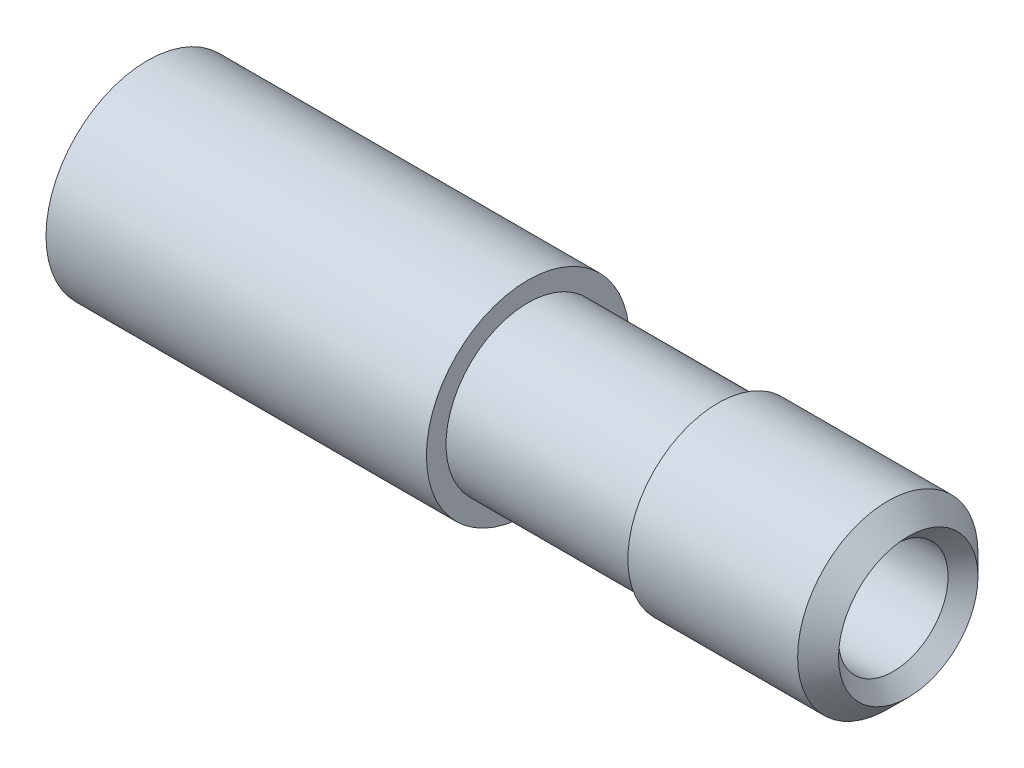
ISO-10303-21;
HEADER;
FILE_DESCRIPTION(('STEP AP214'),'2;1');
FILE_NAME('part.step','',(''),(''),'','','');
FILE_SCHEMA(('AUTOMOTIVE_DESIGN { 1 0 10303 214 1 1 1 1 }'));
ENDSEC;
DATA;
#1=APPLICATION_CONTEXT('core data for automotive mechanical design processes');
#2=APPLICATION_PROTOCOL_DEFINITION('international standard','automotive_design',2000,#1);
#3=PRODUCT_CONTEXT('',#1,'mechanical');
#4=PRODUCT('Part','Part','',(#3));
#5=PRODUCT_RELATED_PRODUCT_CATEGORY('part','',(#4));
#6=PRODUCT_DEFINITION_FORMATION('','',#4);
#7=PRODUCT_DEFINITION_CONTEXT('part definition',#1,'design');
#8=PRODUCT_DEFINITION('design','',#6,#7);
#9=PRODUCT_DEFINITION_SHAPE('','',#8);
#10=(LENGTH_UNIT() NAMED_UNIT(*) SI_UNIT(.MILLI.,.METRE.));
#11=(NAMED_UNIT(*) PLANE_ANGLE_UNIT() SI_UNIT($,.RADIAN.));
#12=(NAMED_UNIT(*) SI_UNIT($,.STERADIAN.) SOLID_ANGLE_UNIT());
#13=UNCERTAINTY_MEASURE_WITH_UNIT(LENGTH_MEASURE(1.E-05),#10,'distance_accuracy_value','');
#14=(GEOMETRIC_REPRESENTATION_CONTEXT(3) GLOBAL_UNCERTAINTY_ASSIGNED_CONTEXT((#13)) GLOBAL_UNIT_ASSIGNED_CONTEXT((#10,
#11,#12)) REPRESENTATION_CONTEXT('',''));
#15=CARTESIAN_POINT('',(0.,0.,0.));
#16=DIRECTION('',(0.,0.,1.));
#17=DIRECTION('',(1.,0.,0.));
#18=AXIS2_PLACEMENT_3D('',#15,#16,#17);
#19=CARTESIAN_POINT('',(0.,0.,0.));
#20=DIRECTION('',(1.,0.,0.));
#21=DIRECTION('',(0.,0.,-1.));
#22=AXIS2_PLACEMENT_3D('',#19,#20,#21);
#23=CYLINDRICAL_SURFACE('',#22,2.16);
#24=CARTESIAN_POINT('',(12.,0.,0.));
#25=DIRECTION('',(-1.,0.,0.));
#26=DIRECTION('',(0.,0.,1.));
#27=AXIS2_PLACEMENT_3D('',#24,#25,#26);
#28=CIRCLE('',#27,2.16);
#29=CARTESIAN_POINT('',(12.,0.,2.16));
#30=VERTEX_POINT('',#29);
#31=EDGE_CURVE('E51',#30,#30,#28,.T.);
#32=ORIENTED_EDGE('',*,*,#31,.T.);
#33=EDGE_LOOP('',(#32));
#34=FACE_BOUND('',#33,.T.);
#35=CARTESIAN_POINT('',(29.41,0.,0.));
#36=DIRECTION('',(1.,0.,0.));
#37=DIRECTION('',(0.,0.,-1.));
#38=AXIS2_PLACEMENT_3D('',#35,#36,#37);
#39=CIRCLE('',#38,2.16);
#40=CARTESIAN_POINT('',(29.41,0.,-2.16));
#41=VERTEX_POINT('',#40);
#42=EDGE_CURVE('E38',#41,#41,#39,.F.);
#43=ORIENTED_EDGE('',*,*,#42,.F.);
#44=EDGE_LOOP('',(#43));
#45=FACE_BOUND('',#44,.T.);
#46=ADVANCED_FACE('F34',(#34,#45),#23,.F.);
#47=CARTESIAN_POINT('',(15.,0.,0.));
#48=DIRECTION('',(1.,0.,0.));
#49=DIRECTION('',(0.,0.,-1.));
#50=AXIS2_PLACEMENT_3D('',#47,#48,#49);
#51=CYLINDRICAL_SURFACE('',#50,3.556);
#52=CARTESIAN_POINT('',(22.5,0.,0.));
#53=DIRECTION('',(1.,0.,0.));
#54=DIRECTION('',(0.,0.,-1.));
#55=AXIS2_PLACEMENT_3D('',#52,#53,#54);
#56=CIRCLE('',#55,3.556);
#57=CARTESIAN_POINT('',(22.5,0.,-3.556));
#58=VERTEX_POINT('',#57);
#59=EDGE_CURVE('E57',#58,#58,#56,.F.);
#60=ORIENTED_EDGE('',*,*,#59,.F.);
#61=EDGE_LOOP('',(#60));
#62=FACE_BOUND('',#61,.T.);
#63=CARTESIAN_POINT('',(29.194,0.,0.));
#64=DIRECTION('',(-1.,0.,0.));
#65=DIRECTION('',(0.,0.,1.));
#66=AXIS2_PLACEMENT_3D('',#63,#64,#65);
#67=CIRCLE('',#66,3.556);
#68=CARTESIAN_POINT('',(29.194,0.,3.556));
#69=VERTEX_POINT('',#68);
#70=EDGE_CURVE('E60',#69,#69,#67,.T.);
#71=ORIENTED_EDGE('',*,*,#70,.T.);
#72=EDGE_LOOP('',(#71));
#73=FACE_BOUND('',#72,.T.);
#74=ADVANCED_FACE('F97',(#62,#73),#51,.T.);
#75=CARTESIAN_POINT('',(30.,0.,0.));
#76=DIRECTION('',(-1.,0.,0.));
#77=DIRECTION('',(0.,0.,1.));
#78=AXIS2_PLACEMENT_3D('',#75,#76,#77);
#79=CYLINDRICAL_SURFACE('',#78,4.);
#80=CARTESIAN_POINT('',(0.,0.,0.));
#81=DIRECTION('',(1.,0.,0.));
#82=DIRECTION('',(0.,0.,-1.));
#83=AXIS2_PLACEMENT_3D('',#80,#81,#82);
#84=CIRCLE('',#83,4.);
#85=CARTESIAN_POINT('',(0.,0.,-4.));
#86=VERTEX_POINT('',#85);
#87=EDGE_CURVE('E11',#86,#86,#84,.T.);
#88=ORIENTED_EDGE('',*,*,#87,.T.);
#89=EDGE_LOOP('',(#88));
#90=FACE_BOUND('',#89,.T.);
#91=CARTESIAN_POINT('',(15.,0.,0.));
#92=DIRECTION('',(1.,0.,0.));
#93=DIRECTION('',(0.,0.,-1.));
#94=AXIS2_PLACEMENT_3D('',#91,#92,#93);
#95=CIRCLE('',#94,4.);
#96=CARTESIAN_POINT('',(15.,0.,-4.));
#97=VERTEX_POINT('',#96);
#98=EDGE_CURVE('E54',#97,#97,#95,.T.);
#99=ORIENTED_EDGE('',*,*,#98,.F.);
#100=EDGE_LOOP('',(#99));
#101=FACE_BOUND('',#100,.T.);
#102=ADVANCED_FACE('F36',(#90,#101),#79,.T.);
#103=CARTESIAN_POINT('',(0.,0.,0.));
#104=DIRECTION('',(1.,0.,0.));
#105=DIRECTION('',(0.,0.,-1.));
#106=AXIS2_PLACEMENT_3D('',#103,#104,#105);
#107=PLANE('',#106);
#108=CARTESIAN_POINT('',(0.,0.,0.));
#109=DIRECTION('',(-1.,0.,0.));
#110=DIRECTION('',(0.,0.,1.));
#111=AXIS2_PLACEMENT_3D('',#108,#109,#110);
#112=CIRCLE('',#111,2.5);
#113=CARTESIAN_POINT('',(0.,0.,2.5));
#114=VERTEX_POINT('',#113);
#115=EDGE_CURVE('E47',#114,#114,#112,.T.);
#116=ORIENTED_EDGE('',*,*,#115,.F.);
#117=EDGE_LOOP('',(#116));
#118=FACE_BOUND('',#117,.T.);
#119=ORIENTED_EDGE('',*,*,#87,.F.);
#120=EDGE_LOOP('',(#119));
#121=FACE_BOUND('',#120,.T.);
#122=ADVANCED_FACE('F106',(#118,#121),#107,.F.);
#123=CARTESIAN_POINT('',(12.,0.,0.));
#124=DIRECTION('',(-1.,0.,0.));
#125=DIRECTION('',(0.,0.,1.));
#126=AXIS2_PLACEMENT_3D('',#123,#124,#125);
#127=CYLINDRICAL_SURFACE('',#126,2.5);
#128=CARTESIAN_POINT('',(12.,0.,0.));
#129=DIRECTION('',(-1.,0.,0.));
#130=DIRECTION('',(0.,0.,1.));
#131=AXIS2_PLACEMENT_3D('',#128,#129,#130);
#132=CIRCLE('',#131,2.5);
#133=CARTESIAN_POINT('',(12.,0.,2.5));
#134=VERTEX_POINT('',#133);
#135=EDGE_CURVE('E42',#134,#134,#132,.T.);
#136=ORIENTED_EDGE('',*,*,#135,.F.);
#137=EDGE_LOOP('',(#136));
#138=FACE_BOUND('',#137,.T.);
#139=ORIENTED_EDGE('',*,*,#115,.T.);
#140=EDGE_LOOP('',(#139));
#141=FACE_BOUND('',#140,.T.);
#142=ADVANCED_FACE('F91',(#138,#141),#127,.F.);
#143=CARTESIAN_POINT('',(12.,0.,0.));
#144=DIRECTION('',(-1.,0.,0.));
#145=DIRECTION('',(0.,0.,1.));
#146=AXIS2_PLACEMENT_3D('',#143,#144,#145);
#147=PLANE('',#146);
#148=ORIENTED_EDGE('',*,*,#31,.F.);
#149=EDGE_LOOP('',(#148));
#150=FACE_BOUND('',#149,.T.);
#151=ORIENTED_EDGE('',*,*,#135,.T.);
#152=EDGE_LOOP('',(#151));
#153=FACE_BOUND('',#152,.T.);
#154=ADVANCED_FACE('F82',(#150,#153),#147,.T.);
#155=CARTESIAN_POINT('',(15.,0.,0.));
#156=DIRECTION('',(1.,0.,0.));
#157=DIRECTION('',(0.,0.,-1.));
#158=AXIS2_PLACEMENT_3D('',#155,#156,#157);
#159=PLANE('',#158);
#160=ORIENTED_EDGE('',*,*,#98,.T.);
#161=EDGE_LOOP('',(#160));
#162=FACE_BOUND('',#161,.T.);
#163=CARTESIAN_POINT('',(15.,0.,0.));
#164=DIRECTION('',(1.,0.,0.));
#165=DIRECTION('',(0.,0.,-1.));
#166=AXIS2_PLACEMENT_3D('',#163,#164,#165);
#167=CIRCLE('',#166,3.22557199528036);
#168=CARTESIAN_POINT('',(15.,0.,-3.22557199528036));
#169=VERTEX_POINT('',#168);
#170=EDGE_CURVE('E66',#169,#169,#167,.T.);
#171=ORIENTED_EDGE('',*,*,#170,.F.);
#172=EDGE_LOOP('',(#171));
#173=FACE_BOUND('',#172,.T.);
#174=ADVANCED_FACE('F79',(#162,#173),#159,.T.);
#175=CARTESIAN_POINT('',(22.5,0.,0.));
#176=DIRECTION('',(1.,0.,0.));
#177=DIRECTION('',(0.,0.,-1.));
#178=AXIS2_PLACEMENT_3D('',#175,#176,#177);
#179=PLANE('',#178);
#180=ORIENTED_EDGE('',*,*,#59,.T.);
#181=EDGE_LOOP('',(#180));
#182=FACE_BOUND('',#181,.T.);
#183=CARTESIAN_POINT('',(22.5,0.,0.));
#184=DIRECTION('',(1.,0.,0.));
#185=DIRECTION('',(0.,0.,-1.));
#186=AXIS2_PLACEMENT_3D('',#183,#184,#185);
#187=CIRCLE('',#186,3.22557199528036);
#188=CARTESIAN_POINT('',(22.5,0.,-3.22557199528036));
#189=VERTEX_POINT('',#188);
#190=EDGE_CURVE('E59',#189,#189,#187,.T.);
#191=ORIENTED_EDGE('',*,*,#190,.T.);
#192=EDGE_LOOP('',(#191));
#193=FACE_BOUND('',#192,.T.);
#194=ADVANCED_FACE('F81',(#182,#193),#179,.F.);
#195=CARTESIAN_POINT('',(22.5,0.,0.));
#196=DIRECTION('',(-1.,0.,0.));
#197=DIRECTION('',(0.,0.,1.));
#198=AXIS2_PLACEMENT_3D('',#195,#196,#197);
#199=CYLINDRICAL_SURFACE('',#198,3.22557199528036);
#200=ORIENTED_EDGE('',*,*,#190,.F.);
#201=EDGE_LOOP('',(#200));
#202=FACE_BOUND('',#201,.T.);
#203=ORIENTED_EDGE('',*,*,#170,.T.);
#204=EDGE_LOOP('',(#203));
#205=FACE_BOUND('',#204,.T.);
#206=ADVANCED_FACE('F77',(#202,#205),#199,.T.);
#207=CARTESIAN_POINT('',(30.,0.,0.));
#208=DIRECTION('',(1.,0.,0.));
#209=DIRECTION('',(0.,0.,-1.));
#210=AXIS2_PLACEMENT_3D('',#207,#208,#209);
#211=CONICAL_SURFACE('',#210,2.75,0.785398163397454);
#212=CARTESIAN_POINT('',(30.,0.,0.));
#213=DIRECTION('',(-1.,0.,0.));
#214=DIRECTION('',(0.,0.,1.));
#215=AXIS2_PLACEMENT_3D('',#212,#213,#214);
#216=CIRCLE('',#215,2.75);
#217=CARTESIAN_POINT('',(30.,0.,2.75));
#218=VERTEX_POINT('',#217);
#219=EDGE_CURVE('E62',#218,#218,#216,.T.);
#220=ORIENTED_EDGE('',*,*,#219,.F.);
#221=EDGE_LOOP('',(#220));
#222=FACE_BOUND('',#221,.T.);
#223=ORIENTED_EDGE('',*,*,#42,.T.);
#224=EDGE_LOOP('',(#223));
#225=FACE_BOUND('',#224,.T.);
#226=ADVANCED_FACE('F135',(#222,#225),#211,.F.);
#227=CARTESIAN_POINT('',(28.8407340401249,0.,0.));
#228=DIRECTION('',(-1.,0.,0.));
#229=DIRECTION('',(0.,0.,1.));
#230=AXIS2_PLACEMENT_3D('',#227,#228,#229);
#231=CONICAL_SURFACE('',#230,3.90926595987511,0.785398163397443);
#232=ORIENTED_EDGE('',*,*,#70,.F.);
#233=EDGE_LOOP('',(#232));
#234=FACE_BOUND('',#233,.T.);
#235=ORIENTED_EDGE('',*,*,#219,.T.);
#236=EDGE_LOOP('',(#235));
#237=FACE_BOUND('',#236,.T.);
#238=ADVANCED_FACE('F140',(#234,#237),#231,.T.);
#239=CLOSED_SHELL('',(#46,#74,#102,#122,#142,#154,#174,#194,#206,#226,#238));
#240=MANIFOLD_SOLID_BREP('B2',#239);
#241=ADVANCED_BREP_SHAPE_REPRESENTATION('',(#18,#240),#14);
#242=SHAPE_DEFINITION_REPRESENTATION(#9,#241);
ENDSEC;
END-ISO-10303-21;
